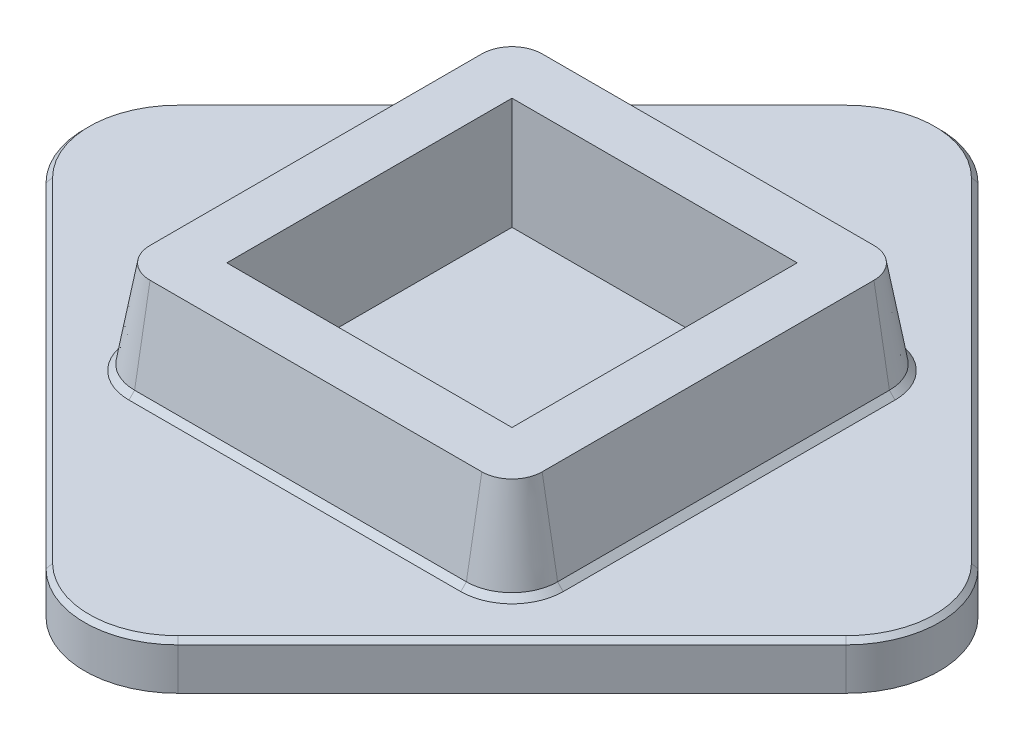
ISO-10303-21;
HEADER;
FILE_DESCRIPTION(('STEP AP214'),'2;1');
FILE_NAME('part.step','',(''),(''),'','','');
FILE_SCHEMA(('AUTOMOTIVE_DESIGN { 1 0 10303 214 1 1 1 1 }'));
ENDSEC;
DATA;
#1=APPLICATION_CONTEXT('core data for automotive mechanical design processes');
#2=APPLICATION_PROTOCOL_DEFINITION('international standard','automotive_design',2000,#1);
#3=PRODUCT_CONTEXT('',#1,'mechanical');
#4=PRODUCT('Part','Part','',(#3));
#5=PRODUCT_RELATED_PRODUCT_CATEGORY('part','',(#4));
#6=PRODUCT_DEFINITION_FORMATION('','',#4);
#7=PRODUCT_DEFINITION_CONTEXT('part definition',#1,'design');
#8=PRODUCT_DEFINITION('design','',#6,#7);
#9=PRODUCT_DEFINITION_SHAPE('','',#8);
#10=(LENGTH_UNIT() NAMED_UNIT(*) SI_UNIT(.MILLI.,.METRE.));
#11=(NAMED_UNIT(*) PLANE_ANGLE_UNIT() SI_UNIT($,.RADIAN.));
#12=(NAMED_UNIT(*) SI_UNIT($,.STERADIAN.) SOLID_ANGLE_UNIT());
#13=UNCERTAINTY_MEASURE_WITH_UNIT(LENGTH_MEASURE(1.E-05),#10,'distance_accuracy_value','');
#14=(GEOMETRIC_REPRESENTATION_CONTEXT(3) GLOBAL_UNCERTAINTY_ASSIGNED_CONTEXT((#13)) GLOBAL_UNIT_ASSIGNED_CONTEXT((#10,
#11,#12)) REPRESENTATION_CONTEXT('',''));
#15=CARTESIAN_POINT('',(0.,0.,0.));
#16=DIRECTION('',(0.,0.,1.));
#17=DIRECTION('',(1.,0.,0.));
#18=AXIS2_PLACEMENT_3D('',#15,#16,#17);
#19=CARTESIAN_POINT('',(17.8,15.,-17.8));
#20=DIRECTION('',(0.,1.,0.));
#21=DIRECTION('',(0.,0.,1.));
#22=AXIS2_PLACEMENT_3D('',#19,#20,#21);
#23=PLANE('',#22);
#24=CARTESIAN_POINT('',(17.8,15.,-17.8));
#25=DIRECTION('',(0.,1.,0.));
#26=DIRECTION('',(0.,0.,1.));
#27=AXIS2_PLACEMENT_3D('',#24,#25,#26);
#28=CIRCLE('',#27,3.23673019291535);
#29=CARTESIAN_POINT('',(21.0367301929153,15.,-17.8));
#30=VERTEX_POINT('',#29);
#31=CARTESIAN_POINT('',(17.8,15.,-21.0367301929153));
#32=VERTEX_POINT('',#31);
#33=EDGE_CURVE('E253',#30,#32,#28,.T.);
#34=ORIENTED_EDGE('',*,*,#33,.T.);
#35=DIRECTION('',(1.,0.,0.));
#36=VECTOR('',#35,1.);
#37=CARTESIAN_POINT('',(0.,15.,-21.0367301929153));
#38=LINE('',#37,#36);
#39=CARTESIAN_POINT('',(-17.8,15.,-21.0367301929153));
#40=VERTEX_POINT('',#39);
#41=EDGE_CURVE('E290',#40,#32,#38,.T.);
#42=ORIENTED_EDGE('',*,*,#41,.F.);
#43=CARTESIAN_POINT('',(-17.8,15.,-17.8));
#44=DIRECTION('',(0.,1.,0.));
#45=DIRECTION('',(0.,0.,1.));
#46=AXIS2_PLACEMENT_3D('',#43,#44,#45);
#47=CIRCLE('',#46,3.23673019291535);
#48=CARTESIAN_POINT('',(-21.0367301929153,15.,-17.8));
#49=VERTEX_POINT('',#48);
#50=EDGE_CURVE('E293',#40,#49,#47,.T.);
#51=ORIENTED_EDGE('',*,*,#50,.T.);
#52=DIRECTION('',(0.,0.,-1.));
#53=VECTOR('',#52,1.);
#54=CARTESIAN_POINT('',(-21.0367301929153,15.,0.));
#55=LINE('',#54,#53);
#56=CARTESIAN_POINT('',(-21.0367301929153,15.,17.8));
#57=VERTEX_POINT('',#56);
#58=EDGE_CURVE('E295',#49,#57,#55,.F.);
#59=ORIENTED_EDGE('',*,*,#58,.T.);
#60=CARTESIAN_POINT('',(-17.8,15.,17.8));
#61=DIRECTION('',(0.,1.,0.));
#62=DIRECTION('',(0.,0.,1.));
#63=AXIS2_PLACEMENT_3D('',#60,#61,#62);
#64=CIRCLE('',#63,3.23673019291535);
#65=CARTESIAN_POINT('',(-17.8,15.,21.0367301929153));
#66=VERTEX_POINT('',#65);
#67=EDGE_CURVE('E297',#57,#66,#64,.T.);
#68=ORIENTED_EDGE('',*,*,#67,.T.);
#69=DIRECTION('',(-1.,0.,0.));
#70=VECTOR('',#69,1.);
#71=CARTESIAN_POINT('',(0.,15.,21.0367301929153));
#72=LINE('',#71,#70);
#73=CARTESIAN_POINT('',(17.8,15.,21.0367301929153));
#74=VERTEX_POINT('',#73);
#75=EDGE_CURVE('E299',#66,#74,#72,.F.);
#76=ORIENTED_EDGE('',*,*,#75,.T.);
#77=CARTESIAN_POINT('',(17.8,15.,17.8));
#78=DIRECTION('',(0.,1.,0.));
#79=DIRECTION('',(0.,0.,1.));
#80=AXIS2_PLACEMENT_3D('',#77,#78,#79);
#81=CIRCLE('',#80,3.23673019291535);
#82=CARTESIAN_POINT('',(21.0367301929153,15.,17.8));
#83=VERTEX_POINT('',#82);
#84=EDGE_CURVE('E301',#74,#83,#81,.T.);
#85=ORIENTED_EDGE('',*,*,#84,.T.);
#86=DIRECTION('',(0.,0.,1.));
#87=VECTOR('',#86,1.);
#88=CARTESIAN_POINT('',(21.0367301929153,15.,0.));
#89=LINE('',#88,#87);
#90=EDGE_CURVE('E274',#30,#83,#89,.T.);
#91=ORIENTED_EDGE('',*,*,#90,.F.);
#92=EDGE_LOOP('',(#34,#42,#51,#59,#68,#76,#85,#91));
#93=FACE_BOUND('',#92,.T.);
#94=DIRECTION('',(0.,0.,-1.));
#95=VECTOR('',#94,1.);
#96=CARTESIAN_POINT('',(15.3,15.,15.3));
#97=LINE('',#96,#95);
#98=CARTESIAN_POINT('',(15.3,15.,15.3));
#99=VERTEX_POINT('',#98);
#100=CARTESIAN_POINT('',(15.3,15.,-15.3));
#101=VERTEX_POINT('',#100);
#102=EDGE_CURVE('E233',#99,#101,#97,.T.);
#103=ORIENTED_EDGE('',*,*,#102,.F.);
#104=DIRECTION('',(1.,0.,0.));
#105=VECTOR('',#104,1.);
#106=CARTESIAN_POINT('',(-15.3,15.,15.3));
#107=LINE('',#106,#105);
#108=CARTESIAN_POINT('',(-15.3,15.,15.3));
#109=VERTEX_POINT('',#108);
#110=EDGE_CURVE('E243',#109,#99,#107,.T.);
#111=ORIENTED_EDGE('',*,*,#110,.F.);
#112=DIRECTION('',(0.,0.,1.));
#113=VECTOR('',#112,1.);
#114=CARTESIAN_POINT('',(-15.3,15.,-15.3));
#115=LINE('',#114,#113);
#116=CARTESIAN_POINT('',(-15.3,15.,-15.3));
#117=VERTEX_POINT('',#116);
#118=EDGE_CURVE('E249',#117,#109,#115,.T.);
#119=ORIENTED_EDGE('',*,*,#118,.F.);
#120=DIRECTION('',(-1.,0.,0.));
#121=VECTOR('',#120,1.);
#122=CARTESIAN_POINT('',(15.3,15.,-15.3));
#123=LINE('',#122,#121);
#124=EDGE_CURVE('E251',#101,#117,#123,.T.);
#125=ORIENTED_EDGE('',*,*,#124,.F.);
#126=EDGE_LOOP('',(#103,#111,#119,#125));
#127=FACE_BOUND('',#126,.T.);
#128=ADVANCED_FACE('F41',(#93,#127),#23,.T.);
#129=CARTESIAN_POINT('',(25.,5.,-25.));
#130=DIRECTION('',(-0.707106781186547,0.,0.707106781186548));
#131=DIRECTION('',(0.707106781186548,0.,0.707106781186547));
#132=AXIS2_PLACEMENT_3D('',#129,#130,#131);
#133=PLANE('',#132);
#134=DIRECTION('',(0.,-1.,0.));
#135=VECTOR('',#134,1.);
#136=CARTESIAN_POINT('',(7.07106781186547,5.,-42.9289321881345));
#137=LINE('',#136,#135);
#138=CARTESIAN_POINT('',(7.07106781186547,4.5,-42.9289321881345));
#139=VERTEX_POINT('',#138);
#140=CARTESIAN_POINT('',(7.07106781186547,0.,-42.9289321881345));
#141=VERTEX_POINT('',#140);
#142=EDGE_CURVE('E342',#139,#141,#137,.T.);
#143=ORIENTED_EDGE('',*,*,#142,.F.);
#144=DIRECTION('',(0.707106781186548,0.,0.707106781186547));
#145=VECTOR('',#144,1.);
#146=CARTESIAN_POINT('',(42.9289321881345,4.5,-7.07106781186548));
#147=LINE('',#146,#145);
#148=CARTESIAN_POINT('',(42.9289321881345,4.5,-7.07106781186547));
#149=VERTEX_POINT('',#148);
#150=EDGE_CURVE('E393',#139,#149,#147,.T.);
#151=ORIENTED_EDGE('',*,*,#150,.T.);
#152=DIRECTION('',(0.,-1.,0.));
#153=VECTOR('',#152,1.);
#154=CARTESIAN_POINT('',(42.9289321881345,5.,-7.07106781186547));
#155=LINE('',#154,#153);
#156=CARTESIAN_POINT('',(42.9289321881345,0.,-7.07106781186547));
#157=VERTEX_POINT('',#156);
#158=EDGE_CURVE('E328',#149,#157,#155,.T.);
#159=ORIENTED_EDGE('',*,*,#158,.T.);
#160=DIRECTION('',(-0.707106781186548,0.,-0.707106781186547));
#161=VECTOR('',#160,1.);
#162=CARTESIAN_POINT('',(25.,0.,-25.));
#163=LINE('',#162,#161);
#164=EDGE_CURVE('E269',#157,#141,#163,.T.);
#165=ORIENTED_EDGE('',*,*,#164,.T.);
#166=EDGE_LOOP('',(#143,#151,#159,#165));
#167=FACE_BOUND('',#166,.T.);
#168=ADVANCED_FACE('F519',(#167),#133,.F.);
#169=CARTESIAN_POINT('',(0.,5.,-35.8578643762691));
#170=DIRECTION('',(0.,-1.,0.));
#171=DIRECTION('',(0.,0.,-1.));
#172=AXIS2_PLACEMENT_3D('',#169,#170,#171);
#173=CYLINDRICAL_SURFACE('',#172,10.);
#174=DIRECTION('',(0.,-1.,0.));
#175=VECTOR('',#174,1.);
#176=CARTESIAN_POINT('',(-7.07106781186547,5.,-42.9289321881345));
#177=LINE('',#176,#175);
#178=CARTESIAN_POINT('',(-7.07106781186547,4.5,-42.9289321881345));
#179=VERTEX_POINT('',#178);
#180=CARTESIAN_POINT('',(-7.07106781186547,0.,-42.9289321881345));
#181=VERTEX_POINT('',#180);
#182=EDGE_CURVE('E340',#179,#181,#177,.T.);
#183=ORIENTED_EDGE('',*,*,#182,.F.);
#184=CARTESIAN_POINT('',(0.,4.5,-35.8578643762691));
#185=DIRECTION('',(0.,1.,0.));
#186=DIRECTION('',(0.,0.,1.));
#187=AXIS2_PLACEMENT_3D('',#184,#185,#186);
#188=CIRCLE('',#187,10.);
#189=EDGE_CURVE('E391',#179,#139,#188,.F.);
#190=ORIENTED_EDGE('',*,*,#189,.T.);
#191=ORIENTED_EDGE('',*,*,#142,.T.);
#192=CARTESIAN_POINT('',(0.,0.,-35.8578643762691));
#193=DIRECTION('',(0.,1.,0.));
#194=DIRECTION('',(0.,0.,1.));
#195=AXIS2_PLACEMENT_3D('',#192,#193,#194);
#196=CIRCLE('',#195,10.);
#197=EDGE_CURVE('E307',#141,#181,#196,.T.);
#198=ORIENTED_EDGE('',*,*,#197,.T.);
#199=EDGE_LOOP('',(#183,#190,#191,#198));
#200=FACE_BOUND('',#199,.T.);
#201=ADVANCED_FACE('F524',(#200),#173,.T.);
#202=CARTESIAN_POINT('',(-25.,5.,-25.));
#203=DIRECTION('',(-0.707106781186547,0.,-0.707106781186548));
#204=DIRECTION('',(-0.707106781186548,0.,0.707106781186547));
#205=AXIS2_PLACEMENT_3D('',#202,#203,#204);
#206=PLANE('',#205);
#207=DIRECTION('',(0.,-1.,0.));
#208=VECTOR('',#207,1.);
#209=CARTESIAN_POINT('',(-42.9289321881345,5.,-7.07106781186547));
#210=LINE('',#209,#208);
#211=CARTESIAN_POINT('',(-42.9289321881345,4.5,-7.07106781186547));
#212=VERTEX_POINT('',#211);
#213=CARTESIAN_POINT('',(-42.9289321881345,0.,-7.07106781186547));
#214=VERTEX_POINT('',#213);
#215=EDGE_CURVE('E338',#212,#214,#210,.T.);
#216=ORIENTED_EDGE('',*,*,#215,.F.);
#217=DIRECTION('',(0.707106781186548,0.,-0.707106781186547));
#218=VECTOR('',#217,1.);
#219=CARTESIAN_POINT('',(-25.,4.5,-25.));
#220=LINE('',#219,#218);
#221=EDGE_CURVE('E389',#212,#179,#220,.T.);
#222=ORIENTED_EDGE('',*,*,#221,.T.);
#223=ORIENTED_EDGE('',*,*,#182,.T.);
#224=DIRECTION('',(0.707106781186548,0.,-0.707106781186547));
#225=VECTOR('',#224,1.);
#226=CARTESIAN_POINT('',(-25.,0.,-25.));
#227=LINE('',#226,#225);
#228=EDGE_CURVE('E310',#214,#181,#227,.T.);
#229=ORIENTED_EDGE('',*,*,#228,.F.);
#230=EDGE_LOOP('',(#216,#222,#223,#229));
#231=FACE_BOUND('',#230,.T.);
#232=ADVANCED_FACE('F575',(#231),#206,.T.);
#233=CARTESIAN_POINT('',(-35.8578643762691,5.,0.));
#234=DIRECTION('',(0.,-1.,0.));
#235=DIRECTION('',(0.,0.,-1.));
#236=AXIS2_PLACEMENT_3D('',#233,#234,#235);
#237=CYLINDRICAL_SURFACE('',#236,10.);
#238=DIRECTION('',(0.,-1.,0.));
#239=VECTOR('',#238,1.);
#240=CARTESIAN_POINT('',(-42.9289321881345,5.,7.07106781186549));
#241=LINE('',#240,#239);
#242=CARTESIAN_POINT('',(-42.9289321881345,4.5,7.07106781186549));
#243=VERTEX_POINT('',#242);
#244=CARTESIAN_POINT('',(-42.9289321881345,0.,7.07106781186549));
#245=VERTEX_POINT('',#244);
#246=EDGE_CURVE('E336',#243,#245,#241,.T.);
#247=ORIENTED_EDGE('',*,*,#246,.F.);
#248=CARTESIAN_POINT('',(-35.8578643762691,4.5,0.));
#249=DIRECTION('',(0.,1.,0.));
#250=DIRECTION('',(0.,0.,1.));
#251=AXIS2_PLACEMENT_3D('',#248,#249,#250);
#252=CIRCLE('',#251,10.);
#253=EDGE_CURVE('E387',#243,#212,#252,.F.);
#254=ORIENTED_EDGE('',*,*,#253,.T.);
#255=ORIENTED_EDGE('',*,*,#215,.T.);
#256=CARTESIAN_POINT('',(-35.8578643762691,0.,0.));
#257=DIRECTION('',(0.,1.,0.));
#258=DIRECTION('',(0.,0.,1.));
#259=AXIS2_PLACEMENT_3D('',#256,#257,#258);
#260=CIRCLE('',#259,10.);
#261=EDGE_CURVE('E313',#245,#214,#260,.F.);
#262=ORIENTED_EDGE('',*,*,#261,.F.);
#263=EDGE_LOOP('',(#247,#254,#255,#262));
#264=FACE_BOUND('',#263,.T.);
#265=ADVANCED_FACE('F571',(#264),#237,.T.);
#266=CARTESIAN_POINT('',(-25.,5.,25.));
#267=DIRECTION('',(-0.707106781186547,0.,0.707106781186548));
#268=DIRECTION('',(0.707106781186548,0.,0.707106781186547));
#269=AXIS2_PLACEMENT_3D('',#266,#267,#268);
#270=PLANE('',#269);
#271=DIRECTION('',(0.,-1.,0.));
#272=VECTOR('',#271,1.);
#273=CARTESIAN_POINT('',(-7.07106781186547,5.,42.9289321881345));
#274=LINE('',#273,#272);
#275=CARTESIAN_POINT('',(-7.07106781186547,4.5,42.9289321881345));
#276=VERTEX_POINT('',#275);
#277=CARTESIAN_POINT('',(-7.07106781186547,0.,42.9289321881345));
#278=VERTEX_POINT('',#277);
#279=EDGE_CURVE('E334',#276,#278,#274,.T.);
#280=ORIENTED_EDGE('',*,*,#279,.F.);
#281=DIRECTION('',(-0.707106781186548,0.,-0.707106781186547));
#282=VECTOR('',#281,1.);
#283=CARTESIAN_POINT('',(-25.,4.5,25.));
#284=LINE('',#283,#282);
#285=EDGE_CURVE('E385',#276,#243,#284,.T.);
#286=ORIENTED_EDGE('',*,*,#285,.T.);
#287=ORIENTED_EDGE('',*,*,#246,.T.);
#288=DIRECTION('',(-0.707106781186548,0.,-0.707106781186547));
#289=VECTOR('',#288,1.);
#290=CARTESIAN_POINT('',(-25.,0.,25.));
#291=LINE('',#290,#289);
#292=EDGE_CURVE('E316',#278,#245,#291,.T.);
#293=ORIENTED_EDGE('',*,*,#292,.F.);
#294=EDGE_LOOP('',(#280,#286,#287,#293));
#295=FACE_BOUND('',#294,.T.);
#296=ADVANCED_FACE('F567',(#295),#270,.T.);
#297=CARTESIAN_POINT('',(0.,5.,35.8578643762691));
#298=DIRECTION('',(0.,-1.,0.));
#299=DIRECTION('',(0.,0.,-1.));
#300=AXIS2_PLACEMENT_3D('',#297,#298,#299);
#301=CYLINDRICAL_SURFACE('',#300,9.99999999999999);
#302=DIRECTION('',(0.,-1.,0.));
#303=VECTOR('',#302,1.);
#304=CARTESIAN_POINT('',(7.07106781186547,5.,42.9289321881345));
#305=LINE('',#304,#303);
#306=CARTESIAN_POINT('',(7.07106781186547,4.5,42.9289321881345));
#307=VERTEX_POINT('',#306);
#308=CARTESIAN_POINT('',(7.07106781186547,0.,42.9289321881345));
#309=VERTEX_POINT('',#308);
#310=EDGE_CURVE('E332',#307,#309,#305,.T.);
#311=ORIENTED_EDGE('',*,*,#310,.F.);
#312=CARTESIAN_POINT('',(0.,4.5,35.8578643762691));
#313=DIRECTION('',(0.,1.,0.));
#314=DIRECTION('',(0.,0.,1.));
#315=AXIS2_PLACEMENT_3D('',#312,#313,#314);
#316=CIRCLE('',#315,9.99999999999999);
#317=EDGE_CURVE('E383',#307,#276,#316,.F.);
#318=ORIENTED_EDGE('',*,*,#317,.T.);
#319=ORIENTED_EDGE('',*,*,#279,.T.);
#320=CARTESIAN_POINT('',(0.,0.,35.8578643762691));
#321=DIRECTION('',(0.,1.,0.));
#322=DIRECTION('',(0.,0.,1.));
#323=AXIS2_PLACEMENT_3D('',#320,#321,#322);
#324=CIRCLE('',#323,9.99999999999999);
#325=EDGE_CURVE('E319',#278,#309,#324,.T.);
#326=ORIENTED_EDGE('',*,*,#325,.T.);
#327=EDGE_LOOP('',(#311,#318,#319,#326));
#328=FACE_BOUND('',#327,.T.);
#329=ADVANCED_FACE('F563',(#328),#301,.T.);
#330=CARTESIAN_POINT('',(25.,5.,25.));
#331=DIRECTION('',(-0.707106781186547,0.,-0.707106781186548));
#332=DIRECTION('',(-0.707106781186548,0.,0.707106781186547));
#333=AXIS2_PLACEMENT_3D('',#330,#331,#332);
#334=PLANE('',#333);
#335=DIRECTION('',(0.,-1.,0.));
#336=VECTOR('',#335,1.);
#337=CARTESIAN_POINT('',(42.9289321881345,5.,7.07106781186548));
#338=LINE('',#337,#336);
#339=CARTESIAN_POINT('',(42.9289321881345,4.5,7.07106781186548));
#340=VERTEX_POINT('',#339);
#341=CARTESIAN_POINT('',(42.9289321881345,0.,7.07106781186548));
#342=VERTEX_POINT('',#341);
#343=EDGE_CURVE('E330',#340,#342,#338,.T.);
#344=ORIENTED_EDGE('',*,*,#343,.F.);
#345=DIRECTION('',(-0.707106781186548,0.,0.707106781186547));
#346=VECTOR('',#345,1.);
#347=CARTESIAN_POINT('',(7.07106781186547,4.5,42.9289321881345));
#348=LINE('',#347,#346);
#349=EDGE_CURVE('E381',#340,#307,#348,.T.);
#350=ORIENTED_EDGE('',*,*,#349,.T.);
#351=ORIENTED_EDGE('',*,*,#310,.T.);
#352=DIRECTION('',(0.707106781186548,0.,-0.707106781186547));
#353=VECTOR('',#352,1.);
#354=CARTESIAN_POINT('',(25.,0.,25.));
#355=LINE('',#354,#353);
#356=EDGE_CURVE('E322',#309,#342,#355,.T.);
#357=ORIENTED_EDGE('',*,*,#356,.T.);
#358=EDGE_LOOP('',(#344,#350,#351,#357));
#359=FACE_BOUND('',#358,.T.);
#360=ADVANCED_FACE('F559',(#359),#334,.F.);
#361=CARTESIAN_POINT('',(35.8578643762691,5.,0.));
#362=DIRECTION('',(0.,-1.,0.));
#363=DIRECTION('',(0.,0.,-1.));
#364=AXIS2_PLACEMENT_3D('',#361,#362,#363);
#365=CYLINDRICAL_SURFACE('',#364,10.);
#366=ORIENTED_EDGE('',*,*,#158,.F.);
#367=CARTESIAN_POINT('',(35.8578643762691,4.5,0.));
#368=DIRECTION('',(0.,1.,0.));
#369=DIRECTION('',(0.,0.,1.));
#370=AXIS2_PLACEMENT_3D('',#367,#368,#369);
#371=CIRCLE('',#370,10.);
#372=EDGE_CURVE('E378',#149,#340,#371,.F.);
#373=ORIENTED_EDGE('',*,*,#372,.T.);
#374=ORIENTED_EDGE('',*,*,#343,.T.);
#375=CARTESIAN_POINT('',(35.8578643762691,0.,0.));
#376=DIRECTION('',(0.,1.,0.));
#377=DIRECTION('',(0.,0.,1.));
#378=AXIS2_PLACEMENT_3D('',#375,#376,#377);
#379=CIRCLE('',#378,10.);
#380=EDGE_CURVE('E325',#342,#157,#379,.T.);
#381=ORIENTED_EDGE('',*,*,#380,.T.);
#382=EDGE_LOOP('',(#366,#373,#374,#381));
#383=FACE_BOUND('',#382,.T.);
#384=ADVANCED_FACE('F552',(#383),#365,.T.);
#385=CARTESIAN_POINT('',(0.,5.,0.));
#386=DIRECTION('',(0.,1.,0.));
#387=DIRECTION('',(0.,0.,1.));
#388=AXIS2_PLACEMENT_3D('',#385,#386,#387);
#389=PLANE('',#388);
#390=DIRECTION('',(0.707106781186548,0.,-0.707106781186547));
#391=VECTOR('',#390,1.);
#392=CARTESIAN_POINT('',(42.5753787975413,5.,6.71751442127221));
#393=LINE('',#392,#391);
#394=CARTESIAN_POINT('',(6.7175144212722,5.,42.5753787975413));
#395=VERTEX_POINT('',#394);
#396=CARTESIAN_POINT('',(42.5753787975413,5.,6.71751442127221));
#397=VERTEX_POINT('',#396);
#398=EDGE_CURVE('E373',#395,#397,#393,.T.);
#399=ORIENTED_EDGE('',*,*,#398,.T.);
#400=CARTESIAN_POINT('',(35.8578643762691,5.,0.));
#401=DIRECTION('',(0.,1.,0.));
#402=DIRECTION('',(0.,0.,1.));
#403=AXIS2_PLACEMENT_3D('',#400,#401,#402);
#404=CIRCLE('',#403,9.49999999999999);
#405=CARTESIAN_POINT('',(42.5753787975413,5.,-6.71751442127221));
#406=VERTEX_POINT('',#405);
#407=EDGE_CURVE('E375',#397,#406,#404,.T.);
#408=ORIENTED_EDGE('',*,*,#407,.T.);
#409=DIRECTION('',(-0.707106781186548,0.,-0.707106781186547));
#410=VECTOR('',#409,1.);
#411=CARTESIAN_POINT('',(6.7175144212722,5.,-42.5753787975413));
#412=LINE('',#411,#410);
#413=CARTESIAN_POINT('',(6.71751442127221,5.,-42.5753787975413));
#414=VERTEX_POINT('',#413);
#415=EDGE_CURVE('E361',#406,#414,#412,.T.);
#416=ORIENTED_EDGE('',*,*,#415,.T.);
#417=CARTESIAN_POINT('',(0.,5.,-35.8578643762691));
#418=DIRECTION('',(0.,1.,0.));
#419=DIRECTION('',(0.,0.,1.));
#420=AXIS2_PLACEMENT_3D('',#417,#418,#419);
#421=CIRCLE('',#420,9.5);
#422=CARTESIAN_POINT('',(-6.7175144212722,5.,-42.5753787975413));
#423=VERTEX_POINT('',#422);
#424=EDGE_CURVE('E363',#414,#423,#421,.T.);
#425=ORIENTED_EDGE('',*,*,#424,.T.);
#426=DIRECTION('',(-0.707106781186548,0.,0.707106781186547));
#427=VECTOR('',#426,1.);
#428=CARTESIAN_POINT('',(-24.6464466094067,5.,-24.6464466094067));
#429=LINE('',#428,#427);
#430=CARTESIAN_POINT('',(-42.5753787975413,5.,-6.71751442127221));
#431=VERTEX_POINT('',#430);
#432=EDGE_CURVE('E365',#423,#431,#429,.T.);
#433=ORIENTED_EDGE('',*,*,#432,.T.);
#434=CARTESIAN_POINT('',(-35.8578643762691,5.,0.));
#435=DIRECTION('',(0.,1.,0.));
#436=DIRECTION('',(0.,0.,1.));
#437=AXIS2_PLACEMENT_3D('',#434,#435,#436);
#438=CIRCLE('',#437,9.50000000000001);
#439=CARTESIAN_POINT('',(-42.5753787975413,5.,6.71751442127221));
#440=VERTEX_POINT('',#439);
#441=EDGE_CURVE('E367',#431,#440,#438,.T.);
#442=ORIENTED_EDGE('',*,*,#441,.T.);
#443=DIRECTION('',(0.707106781186548,0.,0.707106781186547));
#444=VECTOR('',#443,1.);
#445=CARTESIAN_POINT('',(-24.6464466094067,5.,24.6464466094067));
#446=LINE('',#445,#444);
#447=CARTESIAN_POINT('',(-6.7175144212722,5.,42.5753787975413));
#448=VERTEX_POINT('',#447);
#449=EDGE_CURVE('E369',#440,#448,#446,.T.);
#450=ORIENTED_EDGE('',*,*,#449,.T.);
#451=CARTESIAN_POINT('',(0.,5.,35.8578643762691));
#452=DIRECTION('',(0.,1.,0.));
#453=DIRECTION('',(0.,0.,1.));
#454=AXIS2_PLACEMENT_3D('',#451,#452,#453);
#455=CIRCLE('',#454,9.5);
#456=EDGE_CURVE('E371',#448,#395,#455,.T.);
#457=ORIENTED_EDGE('',*,*,#456,.T.);
#458=EDGE_LOOP('',(#399,#408,#416,#425,#433,#442,#450,#457));
#459=FACE_BOUND('',#458,.T.);
#460=CARTESIAN_POINT('',(-17.8,5.,-17.8));
#461=DIRECTION('',(0.,1.,0.));
#462=DIRECTION('',(0.,0.,1.));
#463=AXIS2_PLACEMENT_3D('',#460,#461,#462);
#464=CIRCLE('',#463,5.50000000000002);
#465=CARTESIAN_POINT('',(-23.3,5.,-17.8));
#466=VERTEX_POINT('',#465);
#467=CARTESIAN_POINT('',(-17.8,5.,-23.3));
#468=VERTEX_POINT('',#467);
#469=EDGE_CURVE('E356',#466,#468,#464,.F.);
#470=ORIENTED_EDGE('',*,*,#469,.T.);
#471=DIRECTION('',(1.,0.,0.));
#472=VECTOR('',#471,1.);
#473=CARTESIAN_POINT('',(17.8,5.,-23.3));
#474=LINE('',#473,#472);
#475=CARTESIAN_POINT('',(17.8,5.,-23.3));
#476=VERTEX_POINT('',#475);
#477=EDGE_CURVE('E358',#468,#476,#474,.T.);
#478=ORIENTED_EDGE('',*,*,#477,.T.);
#479=CARTESIAN_POINT('',(17.8,5.,-17.8));
#480=DIRECTION('',(0.,1.,0.));
#481=DIRECTION('',(0.,0.,1.));
#482=AXIS2_PLACEMENT_3D('',#479,#480,#481);
#483=CIRCLE('',#482,5.50000000000002);
#484=CARTESIAN_POINT('',(23.3,5.,-17.8));
#485=VERTEX_POINT('',#484);
#486=EDGE_CURVE('E344',#476,#485,#483,.F.);
#487=ORIENTED_EDGE('',*,*,#486,.T.);
#488=DIRECTION('',(0.,0.,1.));
#489=VECTOR('',#488,1.);
#490=CARTESIAN_POINT('',(23.3,5.,17.8));
#491=LINE('',#490,#489);
#492=CARTESIAN_POINT('',(23.3,5.,17.8));
#493=VERTEX_POINT('',#492);
#494=EDGE_CURVE('E346',#485,#493,#491,.T.);
#495=ORIENTED_EDGE('',*,*,#494,.T.);
#496=CARTESIAN_POINT('',(17.8,5.,17.8));
#497=DIRECTION('',(0.,1.,0.));
#498=DIRECTION('',(0.,0.,1.));
#499=AXIS2_PLACEMENT_3D('',#496,#497,#498);
#500=CIRCLE('',#499,5.50000000000002);
#501=CARTESIAN_POINT('',(17.8,5.,23.3));
#502=VERTEX_POINT('',#501);
#503=EDGE_CURVE('E348',#493,#502,#500,.F.);
#504=ORIENTED_EDGE('',*,*,#503,.T.);
#505=DIRECTION('',(-1.,0.,0.));
#506=VECTOR('',#505,1.);
#507=CARTESIAN_POINT('',(0.,5.,23.3));
#508=LINE('',#507,#506);
#509=CARTESIAN_POINT('',(-17.8,5.,23.3));
#510=VERTEX_POINT('',#509);
#511=EDGE_CURVE('E350',#502,#510,#508,.T.);
#512=ORIENTED_EDGE('',*,*,#511,.T.);
#513=CARTESIAN_POINT('',(-17.8,5.,17.8));
#514=DIRECTION('',(0.,1.,0.));
#515=DIRECTION('',(0.,0.,1.));
#516=AXIS2_PLACEMENT_3D('',#513,#514,#515);
#517=CIRCLE('',#516,5.50000000000002);
#518=CARTESIAN_POINT('',(-23.3,5.,17.8));
#519=VERTEX_POINT('',#518);
#520=EDGE_CURVE('E352',#510,#519,#517,.F.);
#521=ORIENTED_EDGE('',*,*,#520,.T.);
#522=DIRECTION('',(0.,0.,-1.));
#523=VECTOR('',#522,1.);
#524=CARTESIAN_POINT('',(-23.3,5.,0.));
#525=LINE('',#524,#523);
#526=EDGE_CURVE('E354',#519,#466,#525,.T.);
#527=ORIENTED_EDGE('',*,*,#526,.T.);
#528=EDGE_LOOP('',(#470,#478,#487,#495,#504,#512,#521,#527));
#529=FACE_BOUND('',#528,.T.);
#530=ADVANCED_FACE('F488',(#459,#529),#389,.T.);
#531=CARTESIAN_POINT('',(0.,0.,0.));
#532=DIRECTION('',(0.,1.,0.));
#533=DIRECTION('',(0.,0.,1.));
#534=AXIS2_PLACEMENT_3D('',#531,#532,#533);
#535=PLANE('',#534);
#536=ORIENTED_EDGE('',*,*,#164,.F.);
#537=ORIENTED_EDGE('',*,*,#380,.F.);
#538=ORIENTED_EDGE('',*,*,#356,.F.);
#539=ORIENTED_EDGE('',*,*,#325,.F.);
#540=ORIENTED_EDGE('',*,*,#292,.T.);
#541=ORIENTED_EDGE('',*,*,#261,.T.);
#542=ORIENTED_EDGE('',*,*,#228,.T.);
#543=ORIENTED_EDGE('',*,*,#197,.F.);
#544=EDGE_LOOP('',(#536,#537,#538,#539,#540,#541,#542,#543));
#545=FACE_BOUND('',#544,.T.);
#546=ADVANCED_FACE('F532',(#545),#535,.F.);
#547=CARTESIAN_POINT('',(17.8,5.,-17.8));
#548=DIRECTION('',(0.,-1.,0.));
#549=DIRECTION('',(0.,0.,1.));
#550=AXIS2_PLACEMENT_3D('',#547,#548,#549);
#551=CONICAL_SURFACE('',#550,5.,0.174532925199433);
#552=DIRECTION('',(0.173648177666931,-0.984807753012208,0.));
#553=VECTOR('',#552,1.);
#554=CARTESIAN_POINT('',(22.8,5.,-17.8));
#555=LINE('',#554,#553);
#556=CARTESIAN_POINT('',(22.6929629983145,5.60703700168555,-17.8));
#557=VERTEX_POINT('',#556);
#558=EDGE_CURVE('E271',#30,#557,#555,.T.);
#559=ORIENTED_EDGE('',*,*,#558,.T.);
#560=CARTESIAN_POINT('',(17.8,5.60703700168555,-17.8));
#561=DIRECTION('',(0.,1.,0.));
#562=DIRECTION('',(0.,0.,1.));
#563=AXIS2_PLACEMENT_3D('',#560,#561,#562);
#564=CIRCLE('',#563,4.89296299831447);
#565=CARTESIAN_POINT('',(17.8,5.60703700168555,-22.6929629983145));
#566=VERTEX_POINT('',#565);
#567=EDGE_CURVE('E11',#557,#566,#564,.T.);
#568=ORIENTED_EDGE('',*,*,#567,.T.);
#569=DIRECTION('',(0.,-0.984807753012208,-0.173648177666931));
#570=VECTOR('',#569,1.);
#571=CARTESIAN_POINT('',(17.8,5.,-22.8));
#572=LINE('',#571,#570);
#573=EDGE_CURVE('E266',#32,#566,#572,.T.);
#574=ORIENTED_EDGE('',*,*,#573,.F.);
#575=ORIENTED_EDGE('',*,*,#33,.F.);
#576=EDGE_LOOP('',(#559,#568,#574,#575));
#577=FACE_BOUND('',#576,.T.);
#578=ADVANCED_FACE('F502',(#577),#551,.T.);
#579=CARTESIAN_POINT('',(0.,5.,-22.8));
#580=DIRECTION('',(0.,0.173648177666931,-0.984807753012208));
#581=DIRECTION('',(0.,0.984807753012208,0.173648177666931));
#582=AXIS2_PLACEMENT_3D('',#579,#580,#581);
#583=PLANE('',#582);
#584=ORIENTED_EDGE('',*,*,#573,.T.);
#585=DIRECTION('',(-1.,0.,0.));
#586=VECTOR('',#585,1.);
#587=CARTESIAN_POINT('',(-17.8,5.60703700168555,-22.6929629983145));
#588=LINE('',#587,#586);
#589=CARTESIAN_POINT('',(-17.8,5.60703700168555,-22.6929629983145));
#590=VERTEX_POINT('',#589);
#591=EDGE_CURVE('E395',#566,#590,#588,.T.);
#592=ORIENTED_EDGE('',*,*,#591,.T.);
#593=DIRECTION('',(0.,-0.984807753012208,-0.173648177666931));
#594=VECTOR('',#593,1.);
#595=CARTESIAN_POINT('',(-17.8,5.,-22.8));
#596=LINE('',#595,#594);
#597=EDGE_CURVE('E270',#40,#590,#596,.T.);
#598=ORIENTED_EDGE('',*,*,#597,.F.);
#599=ORIENTED_EDGE('',*,*,#41,.T.);
#600=EDGE_LOOP('',(#584,#592,#598,#599));
#601=FACE_BOUND('',#600,.T.);
#602=ADVANCED_FACE('F506',(#601),#583,.T.);
#603=CARTESIAN_POINT('',(-17.8,5.,-17.8));
#604=DIRECTION('',(0.,-1.,0.));
#605=DIRECTION('',(0.,0.,1.));
#606=AXIS2_PLACEMENT_3D('',#603,#604,#605);
#607=CONICAL_SURFACE('',#606,5.,0.174532925199433);
#608=ORIENTED_EDGE('',*,*,#597,.T.);
#609=CARTESIAN_POINT('',(-17.8,5.60703700168555,-17.8));
#610=DIRECTION('',(0.,1.,0.));
#611=DIRECTION('',(0.,0.,1.));
#612=AXIS2_PLACEMENT_3D('',#609,#610,#611);
#613=CIRCLE('',#612,4.89296299831447);
#614=CARTESIAN_POINT('',(-22.6929629983145,5.60703700168555,-17.8));
#615=VERTEX_POINT('',#614);
#616=EDGE_CURVE('E398',#590,#615,#613,.T.);
#617=ORIENTED_EDGE('',*,*,#616,.T.);
#618=DIRECTION('',(-0.173648177666931,-0.984807753012208,0.));
#619=VECTOR('',#618,1.);
#620=CARTESIAN_POINT('',(-22.8,5.,-17.8));
#621=LINE('',#620,#619);
#622=EDGE_CURVE('E284',#49,#615,#621,.T.);
#623=ORIENTED_EDGE('',*,*,#622,.F.);
#624=ORIENTED_EDGE('',*,*,#50,.F.);
#625=EDGE_LOOP('',(#608,#617,#623,#624));
#626=FACE_BOUND('',#625,.T.);
#627=ADVANCED_FACE('F544',(#626),#607,.T.);
#628=CARTESIAN_POINT('',(-22.8,5.,0.));
#629=DIRECTION('',(-0.984807753012208,0.173648177666931,0.));
#630=DIRECTION('',(-0.173648177666931,-0.984807753012208,0.));
#631=AXIS2_PLACEMENT_3D('',#628,#629,#630);
#632=PLANE('',#631);
#633=ORIENTED_EDGE('',*,*,#622,.T.);
#634=DIRECTION('',(0.,0.,-1.));
#635=VECTOR('',#634,1.);
#636=CARTESIAN_POINT('',(-22.6929629983145,5.60703700168555,0.));
#637=LINE('',#636,#635);
#638=CARTESIAN_POINT('',(-22.6929629983145,5.60703700168555,17.8));
#639=VERTEX_POINT('',#638);
#640=EDGE_CURVE('E400',#615,#639,#637,.F.);
#641=ORIENTED_EDGE('',*,*,#640,.T.);
#642=DIRECTION('',(-0.173648177666931,-0.984807753012208,0.));
#643=VECTOR('',#642,1.);
#644=CARTESIAN_POINT('',(-22.8,5.,17.8));
#645=LINE('',#644,#643);
#646=EDGE_CURVE('E281',#57,#639,#645,.T.);
#647=ORIENTED_EDGE('',*,*,#646,.F.);
#648=ORIENTED_EDGE('',*,*,#58,.F.);
#649=EDGE_LOOP('',(#633,#641,#647,#648));
#650=FACE_BOUND('',#649,.T.);
#651=ADVANCED_FACE('F474',(#650),#632,.T.);
#652=CARTESIAN_POINT('',(-17.8,5.,17.8));
#653=DIRECTION('',(0.,-1.,0.));
#654=DIRECTION('',(0.,0.,1.));
#655=AXIS2_PLACEMENT_3D('',#652,#653,#654);
#656=CONICAL_SURFACE('',#655,5.,0.174532925199433);
#657=ORIENTED_EDGE('',*,*,#646,.T.);
#658=CARTESIAN_POINT('',(-17.8,5.60703700168555,17.8));
#659=DIRECTION('',(0.,1.,0.));
#660=DIRECTION('',(0.,0.,1.));
#661=AXIS2_PLACEMENT_3D('',#658,#659,#660);
#662=CIRCLE('',#661,4.89296299831447);
#663=CARTESIAN_POINT('',(-17.8,5.60703700168555,22.6929629983145));
#664=VERTEX_POINT('',#663);
#665=EDGE_CURVE('E402',#639,#664,#662,.T.);
#666=ORIENTED_EDGE('',*,*,#665,.T.);
#667=DIRECTION('',(0.,-0.984807753012208,0.173648177666931));
#668=VECTOR('',#667,1.);
#669=CARTESIAN_POINT('',(-17.8,5.,22.8));
#670=LINE('',#669,#668);
#671=EDGE_CURVE('E278',#66,#664,#670,.T.);
#672=ORIENTED_EDGE('',*,*,#671,.F.);
#673=ORIENTED_EDGE('',*,*,#67,.F.);
#674=EDGE_LOOP('',(#657,#666,#672,#673));
#675=FACE_BOUND('',#674,.T.);
#676=ADVANCED_FACE('F472',(#675),#656,.T.);
#677=CARTESIAN_POINT('',(0.,5.,22.8));
#678=DIRECTION('',(0.,0.173648177666931,0.984807753012208));
#679=DIRECTION('',(0.,-0.984807753012208,0.173648177666931));
#680=AXIS2_PLACEMENT_3D('',#677,#678,#679);
#681=PLANE('',#680);
#682=ORIENTED_EDGE('',*,*,#671,.T.);
#683=DIRECTION('',(-1.,0.,0.));
#684=VECTOR('',#683,1.);
#685=CARTESIAN_POINT('',(0.,5.60703700168555,22.6929629983145));
#686=LINE('',#685,#684);
#687=CARTESIAN_POINT('',(17.8,5.60703700168555,22.6929629983145));
#688=VERTEX_POINT('',#687);
#689=EDGE_CURVE('E404',#664,#688,#686,.F.);
#690=ORIENTED_EDGE('',*,*,#689,.T.);
#691=DIRECTION('',(0.,-0.984807753012208,0.173648177666931));
#692=VECTOR('',#691,1.);
#693=CARTESIAN_POINT('',(17.8,5.,22.8));
#694=LINE('',#693,#692);
#695=EDGE_CURVE('E276',#74,#688,#694,.T.);
#696=ORIENTED_EDGE('',*,*,#695,.F.);
#697=ORIENTED_EDGE('',*,*,#75,.F.);
#698=EDGE_LOOP('',(#682,#690,#696,#697));
#699=FACE_BOUND('',#698,.T.);
#700=ADVANCED_FACE('F461',(#699),#681,.T.);
#701=CARTESIAN_POINT('',(17.8,5.,17.8));
#702=DIRECTION('',(0.,-1.,0.));
#703=DIRECTION('',(0.,0.,1.));
#704=AXIS2_PLACEMENT_3D('',#701,#702,#703);
#705=CONICAL_SURFACE('',#704,5.,0.174532925199433);
#706=ORIENTED_EDGE('',*,*,#695,.T.);
#707=CARTESIAN_POINT('',(17.8,5.60703700168555,17.8));
#708=DIRECTION('',(0.,1.,0.));
#709=DIRECTION('',(0.,0.,1.));
#710=AXIS2_PLACEMENT_3D('',#707,#708,#709);
#711=CIRCLE('',#710,4.89296299831447);
#712=CARTESIAN_POINT('',(22.6929629983145,5.60703700168555,17.8));
#713=VERTEX_POINT('',#712);
#714=EDGE_CURVE('E66',#688,#713,#711,.T.);
#715=ORIENTED_EDGE('',*,*,#714,.T.);
#716=DIRECTION('',(0.173648177666931,-0.984807753012208,0.));
#717=VECTOR('',#716,1.);
#718=CARTESIAN_POINT('',(22.8,5.,17.8));
#719=LINE('',#718,#717);
#720=EDGE_CURVE('E273',#83,#713,#719,.T.);
#721=ORIENTED_EDGE('',*,*,#720,.F.);
#722=ORIENTED_EDGE('',*,*,#84,.F.);
#723=EDGE_LOOP('',(#706,#715,#721,#722));
#724=FACE_BOUND('',#723,.T.);
#725=ADVANCED_FACE('F465',(#724),#705,.T.);
#726=CARTESIAN_POINT('',(22.8,5.,0.));
#727=DIRECTION('',(0.984807753012208,0.173648177666931,0.));
#728=DIRECTION('',(-0.173648177666931,0.984807753012208,0.));
#729=AXIS2_PLACEMENT_3D('',#726,#727,#728);
#730=PLANE('',#729);
#731=ORIENTED_EDGE('',*,*,#720,.T.);
#732=DIRECTION('',(0.,0.,-1.));
#733=VECTOR('',#732,1.);
#734=CARTESIAN_POINT('',(22.6929629983145,5.60703700168555,-17.8));
#735=LINE('',#734,#733);
#736=EDGE_CURVE('E51',#713,#557,#735,.T.);
#737=ORIENTED_EDGE('',*,*,#736,.T.);
#738=ORIENTED_EDGE('',*,*,#558,.F.);
#739=ORIENTED_EDGE('',*,*,#90,.T.);
#740=EDGE_LOOP('',(#731,#737,#738,#739));
#741=FACE_BOUND('',#740,.T.);
#742=ADVANCED_FACE('F533',(#741),#730,.T.);
#743=CARTESIAN_POINT('',(-15.3,58.2749350086167,15.3));
#744=DIRECTION('',(0.,0.,-1.));
#745=DIRECTION('',(-1.,0.,0.));
#746=AXIS2_PLACEMENT_3D('',#743,#744,#745);
#747=PLANE('',#746);
#748=ORIENTED_EDGE('',*,*,#110,.T.);
#749=DIRECTION('',(0.,-1.,0.));
#750=VECTOR('',#749,1.);
#751=CARTESIAN_POINT('',(15.3,58.2749350086167,15.3));
#752=LINE('',#751,#750);
#753=CARTESIAN_POINT('',(15.3,3.,15.3));
#754=VERTEX_POINT('',#753);
#755=EDGE_CURVE('E229',#99,#754,#752,.T.);
#756=ORIENTED_EDGE('',*,*,#755,.T.);
#757=DIRECTION('',(1.,0.,0.));
#758=VECTOR('',#757,1.);
#759=CARTESIAN_POINT('',(-15.3,3.,15.3));
#760=LINE('',#759,#758);
#761=CARTESIAN_POINT('',(-15.3,3.,15.3));
#762=VERTEX_POINT('',#761);
#763=EDGE_CURVE('E240',#762,#754,#760,.T.);
#764=ORIENTED_EDGE('',*,*,#763,.F.);
#765=DIRECTION('',(0.,-1.,0.));
#766=VECTOR('',#765,1.);
#767=CARTESIAN_POINT('',(-15.3,58.2749350086167,15.3));
#768=LINE('',#767,#766);
#769=EDGE_CURVE('E245',#109,#762,#768,.T.);
#770=ORIENTED_EDGE('',*,*,#769,.F.);
#771=EDGE_LOOP('',(#748,#756,#764,#770));
#772=FACE_BOUND('',#771,.T.);
#773=ADVANCED_FACE('F244',(#772),#747,.T.);
#774=CARTESIAN_POINT('',(15.3,58.2749350086167,15.3));
#775=DIRECTION('',(-1.,0.,0.));
#776=DIRECTION('',(0.,0.,1.));
#777=AXIS2_PLACEMENT_3D('',#774,#775,#776);
#778=PLANE('',#777);
#779=ORIENTED_EDGE('',*,*,#102,.T.);
#780=DIRECTION('',(0.,-1.,0.));
#781=VECTOR('',#780,1.);
#782=CARTESIAN_POINT('',(15.3,58.2749350086167,-15.3));
#783=LINE('',#782,#781);
#784=CARTESIAN_POINT('',(15.3,3.,-15.3));
#785=VERTEX_POINT('',#784);
#786=EDGE_CURVE('E259',#101,#785,#783,.T.);
#787=ORIENTED_EDGE('',*,*,#786,.T.);
#788=DIRECTION('',(0.,0.,-1.));
#789=VECTOR('',#788,1.);
#790=CARTESIAN_POINT('',(15.3,3.,15.3));
#791=LINE('',#790,#789);
#792=EDGE_CURVE('E236',#754,#785,#791,.T.);
#793=ORIENTED_EDGE('',*,*,#792,.F.);
#794=ORIENTED_EDGE('',*,*,#755,.F.);
#795=EDGE_LOOP('',(#779,#787,#793,#794));
#796=FACE_BOUND('',#795,.T.);
#797=ADVANCED_FACE('F231',(#796),#778,.T.);
#798=CARTESIAN_POINT('',(15.3,58.2749350086167,-15.3));
#799=DIRECTION('',(0.,0.,1.));
#800=DIRECTION('',(1.,0.,0.));
#801=AXIS2_PLACEMENT_3D('',#798,#799,#800);
#802=PLANE('',#801);
#803=ORIENTED_EDGE('',*,*,#124,.T.);
#804=DIRECTION('',(0.,-1.,0.));
#805=VECTOR('',#804,1.);
#806=CARTESIAN_POINT('',(-15.3,58.2749350086167,-15.3));
#807=LINE('',#806,#805);
#808=CARTESIAN_POINT('',(-15.3,3.,-15.3));
#809=VERTEX_POINT('',#808);
#810=EDGE_CURVE('E262',#117,#809,#807,.T.);
#811=ORIENTED_EDGE('',*,*,#810,.T.);
#812=DIRECTION('',(-1.,0.,0.));
#813=VECTOR('',#812,1.);
#814=CARTESIAN_POINT('',(15.3,3.,-15.3));
#815=LINE('',#814,#813);
#816=EDGE_CURVE('E261',#785,#809,#815,.T.);
#817=ORIENTED_EDGE('',*,*,#816,.F.);
#818=ORIENTED_EDGE('',*,*,#786,.F.);
#819=EDGE_LOOP('',(#803,#811,#817,#818));
#820=FACE_BOUND('',#819,.T.);
#821=ADVANCED_FACE('F687',(#820),#802,.T.);
#822=CARTESIAN_POINT('',(-15.3,58.2749350086167,-15.3));
#823=DIRECTION('',(1.,0.,0.));
#824=DIRECTION('',(0.,0.,-1.));
#825=AXIS2_PLACEMENT_3D('',#822,#823,#824);
#826=PLANE('',#825);
#827=ORIENTED_EDGE('',*,*,#118,.T.);
#828=ORIENTED_EDGE('',*,*,#769,.T.);
#829=DIRECTION('',(0.,0.,1.));
#830=VECTOR('',#829,1.);
#831=CARTESIAN_POINT('',(-15.3,3.,-15.3));
#832=LINE('',#831,#830);
#833=EDGE_CURVE('E257',#809,#762,#832,.T.);
#834=ORIENTED_EDGE('',*,*,#833,.F.);
#835=ORIENTED_EDGE('',*,*,#810,.F.);
#836=EDGE_LOOP('',(#827,#828,#834,#835));
#837=FACE_BOUND('',#836,.T.);
#838=ADVANCED_FACE('F641',(#837),#826,.T.);
#839=CARTESIAN_POINT('',(0.,3.,0.));
#840=DIRECTION('',(0.,1.,0.));
#841=DIRECTION('',(0.,0.,1.));
#842=AXIS2_PLACEMENT_3D('',#839,#840,#841);
#843=PLANE('',#842);
#844=ORIENTED_EDGE('',*,*,#763,.T.);
#845=ORIENTED_EDGE('',*,*,#792,.T.);
#846=ORIENTED_EDGE('',*,*,#816,.T.);
#847=ORIENTED_EDGE('',*,*,#833,.T.);
#848=EDGE_LOOP('',(#844,#845,#846,#847));
#849=FACE_BOUND('',#848,.T.);
#850=ADVANCED_FACE('F636',(#849),#843,.T.);
#851=CARTESIAN_POINT('',(-35.8578643762691,4.5,0.));
#852=DIRECTION('',(0.,-1.,0.));
#853=DIRECTION('',(0.,0.,-1.));
#854=AXIS2_PLACEMENT_3D('',#851,#852,#853);
#855=CONICAL_SURFACE('',#854,10.,0.785398163397448);
#856=DIRECTION('',(0.499999999999999,0.707106781186549,0.5));
#857=VECTOR('',#856,1.);
#858=CARTESIAN_POINT('',(-42.9289321881345,4.5,-7.07106781186548));
#859=LINE('',#858,#857);
#860=EDGE_CURVE('E424',#212,#431,#859,.T.);
#861=ORIENTED_EDGE('',*,*,#860,.F.);
#862=ORIENTED_EDGE('',*,*,#253,.F.);
#863=DIRECTION('',(-0.499999999999998,-0.707106781186548,0.500000000000001));
#864=VECTOR('',#863,1.);
#865=CARTESIAN_POINT('',(-42.5753787975413,5.,6.71751442127221));
#866=LINE('',#865,#864);
#867=EDGE_CURVE('E265',#440,#243,#866,.T.);
#868=ORIENTED_EDGE('',*,*,#867,.F.);
#869=ORIENTED_EDGE('',*,*,#441,.F.);
#870=EDGE_LOOP('',(#861,#862,#868,#869));
#871=FACE_BOUND('',#870,.T.);
#872=ADVANCED_FACE('F631',(#871),#855,.T.);
#873=CARTESIAN_POINT('',(-25.,4.5,25.));
#874=DIRECTION('',(0.500000000000003,-0.707106781186542,-0.500000000000004));
#875=DIRECTION('',(-0.707106781186548,0.,-0.707106781186547));
#876=AXIS2_PLACEMENT_3D('',#873,#874,#875);
#877=PLANE('',#876);
#878=ORIENTED_EDGE('',*,*,#867,.T.);
#879=ORIENTED_EDGE('',*,*,#285,.F.);
#880=DIRECTION('',(-0.499999999999999,-0.707106781186549,0.499999999999999));
#881=VECTOR('',#880,1.);
#882=CARTESIAN_POINT('',(-6.7175144212722,5.,42.5753787975413));
#883=LINE('',#882,#881);
#884=EDGE_CURVE('E421',#448,#276,#883,.T.);
#885=ORIENTED_EDGE('',*,*,#884,.F.);
#886=ORIENTED_EDGE('',*,*,#449,.F.);
#887=EDGE_LOOP('',(#878,#879,#885,#886));
#888=FACE_BOUND('',#887,.T.);
#889=ADVANCED_FACE('F625',(#888),#877,.F.);
#890=CARTESIAN_POINT('',(-25.,4.5,-25.));
#891=DIRECTION('',(0.500000000000004,-0.707106781186542,0.500000000000004));
#892=DIRECTION('',(0.707106781186548,0.,-0.707106781186547));
#893=AXIS2_PLACEMENT_3D('',#890,#891,#892);
#894=PLANE('',#893);
#895=ORIENTED_EDGE('',*,*,#860,.T.);
#896=ORIENTED_EDGE('',*,*,#432,.F.);
#897=DIRECTION('',(0.499999999999999,0.707106781186549,0.499999999999999));
#898=VECTOR('',#897,1.);
#899=CARTESIAN_POINT('',(-7.07106781186547,4.5,-42.9289321881345));
#900=LINE('',#899,#898);
#901=EDGE_CURVE('E418',#179,#423,#900,.T.);
#902=ORIENTED_EDGE('',*,*,#901,.F.);
#903=ORIENTED_EDGE('',*,*,#221,.F.);
#904=EDGE_LOOP('',(#895,#896,#902,#903));
#905=FACE_BOUND('',#904,.T.);
#906=ADVANCED_FACE('F618',(#905),#894,.F.);
#907=CARTESIAN_POINT('',(0.,5.,35.8578643762691));
#908=DIRECTION('',(0.,-1.,0.));
#909=DIRECTION('',(0.,0.,-1.));
#910=AXIS2_PLACEMENT_3D('',#907,#908,#909);
#911=CONICAL_SURFACE('',#910,9.5,0.785398163397447);
#912=ORIENTED_EDGE('',*,*,#884,.T.);
#913=ORIENTED_EDGE('',*,*,#317,.F.);
#914=DIRECTION('',(0.499999999999999,-0.707106781186549,0.499999999999999));
#915=VECTOR('',#914,1.);
#916=CARTESIAN_POINT('',(6.7175144212722,5.,42.5753787975413));
#917=LINE('',#916,#915);
#918=EDGE_CURVE('E415',#395,#307,#917,.T.);
#919=ORIENTED_EDGE('',*,*,#918,.F.);
#920=ORIENTED_EDGE('',*,*,#456,.F.);
#921=EDGE_LOOP('',(#912,#913,#919,#920));
#922=FACE_BOUND('',#921,.T.);
#923=ADVANCED_FACE('F611',(#922),#911,.T.);
#924=CARTESIAN_POINT('',(0.,5.,-35.8578643762691));
#925=DIRECTION('',(0.,-1.,0.));
#926=DIRECTION('',(0.,0.,-1.));
#927=AXIS2_PLACEMENT_3D('',#924,#925,#926);
#928=CONICAL_SURFACE('',#927,9.5,0.785398163397448);
#929=ORIENTED_EDGE('',*,*,#901,.T.);
#930=ORIENTED_EDGE('',*,*,#424,.F.);
#931=DIRECTION('',(-0.500000000000001,0.707106781186548,0.499999999999998));
#932=VECTOR('',#931,1.);
#933=CARTESIAN_POINT('',(7.07106781186547,4.5,-42.9289321881345));
#934=LINE('',#933,#932);
#935=EDGE_CURVE('E412',#139,#414,#934,.T.);
#936=ORIENTED_EDGE('',*,*,#935,.F.);
#937=ORIENTED_EDGE('',*,*,#189,.F.);
#938=EDGE_LOOP('',(#929,#930,#936,#937));
#939=FACE_BOUND('',#938,.T.);
#940=ADVANCED_FACE('F604',(#939),#928,.T.);
#941=CARTESIAN_POINT('',(24.6464466094067,5.,24.6464466094067));
#942=DIRECTION('',(0.500000000000004,0.707106781186542,0.500000000000004));
#943=DIRECTION('',(-0.707106781186548,0.,0.707106781186547));
#944=AXIS2_PLACEMENT_3D('',#941,#942,#943);
#945=PLANE('',#944);
#946=ORIENTED_EDGE('',*,*,#918,.T.);
#947=ORIENTED_EDGE('',*,*,#349,.F.);
#948=DIRECTION('',(0.499999999999998,-0.707106781186551,0.499999999999997));
#949=VECTOR('',#948,1.);
#950=CARTESIAN_POINT('',(42.5753787975413,5.,6.71751442127221));
#951=LINE('',#950,#949);
#952=EDGE_CURVE('E410',#397,#340,#951,.T.);
#953=ORIENTED_EDGE('',*,*,#952,.F.);
#954=ORIENTED_EDGE('',*,*,#398,.F.);
#955=EDGE_LOOP('',(#946,#947,#953,#954));
#956=FACE_BOUND('',#955,.T.);
#957=ADVANCED_FACE('F597',(#956),#945,.T.);
#958=CARTESIAN_POINT('',(24.6464466094067,5.,-24.6464466094067));
#959=DIRECTION('',(0.500000000000004,0.707106781186542,-0.500000000000004));
#960=DIRECTION('',(0.707106781186548,0.,0.707106781186547));
#961=AXIS2_PLACEMENT_3D('',#958,#959,#960);
#962=PLANE('',#961);
#963=ORIENTED_EDGE('',*,*,#935,.T.);
#964=ORIENTED_EDGE('',*,*,#415,.F.);
#965=DIRECTION('',(-0.499999999999994,0.707106781186555,0.499999999999996));
#966=VECTOR('',#965,1.);
#967=CARTESIAN_POINT('',(42.9289321881345,4.5,-7.07106781186547));
#968=LINE('',#967,#966);
#969=EDGE_CURVE('E408',#149,#406,#968,.T.);
#970=ORIENTED_EDGE('',*,*,#969,.F.);
#971=ORIENTED_EDGE('',*,*,#150,.F.);
#972=EDGE_LOOP('',(#963,#964,#970,#971));
#973=FACE_BOUND('',#972,.T.);
#974=ADVANCED_FACE('F590',(#973),#962,.T.);
#975=CARTESIAN_POINT('',(35.8578643762691,5.,0.));
#976=DIRECTION('',(0.,-1.,0.));
#977=DIRECTION('',(0.,0.,-1.));
#978=AXIS2_PLACEMENT_3D('',#975,#976,#977);
#979=CONICAL_SURFACE('',#978,9.5,0.78539816339745);
#980=ORIENTED_EDGE('',*,*,#952,.T.);
#981=ORIENTED_EDGE('',*,*,#372,.F.);
#982=ORIENTED_EDGE('',*,*,#969,.T.);
#983=ORIENTED_EDGE('',*,*,#407,.F.);
#984=EDGE_LOOP('',(#980,#981,#982,#983));
#985=FACE_BOUND('',#984,.T.);
#986=ADVANCED_FACE('F584',(#985),#979,.T.);
#987=CARTESIAN_POINT('',(0.,5.60703700168555,22.6929629983145));
#988=DIRECTION('',(0.,0.707106781186544,0.707106781186551));
#989=DIRECTION('',(-1.,0.,0.));
#990=AXIS2_PLACEMENT_3D('',#987,#988,#989);
#991=PLANE('',#990);
#992=DIRECTION('',(0.,-0.70710678118655,0.707106781186545));
#993=VECTOR('',#992,1.);
#994=CARTESIAN_POINT('',(17.8,5.60703700168555,22.6929629983145));
#995=LINE('',#994,#993);
#996=EDGE_CURVE('E444',#688,#502,#995,.T.);
#997=ORIENTED_EDGE('',*,*,#996,.F.);
#998=ORIENTED_EDGE('',*,*,#689,.F.);
#999=DIRECTION('',(0.,0.70710678118655,-0.707106781186545));
#1000=VECTOR('',#999,1.);
#1001=CARTESIAN_POINT('',(-17.8,5.,23.3));
#1002=LINE('',#1001,#1000);
#1003=EDGE_CURVE('E46',#510,#664,#1002,.T.);
#1004=ORIENTED_EDGE('',*,*,#1003,.F.);
#1005=ORIENTED_EDGE('',*,*,#511,.F.);
#1006=EDGE_LOOP('',(#997,#998,#1004,#1005));
#1007=FACE_BOUND('',#1006,.T.);
#1008=ADVANCED_FACE('F44',(#1007),#991,.T.);
#1009=CARTESIAN_POINT('',(-17.8,5.60703700168555,17.8));
#1010=DIRECTION('',(0.,-1.,0.));
#1011=DIRECTION('',(0.,0.,-1.));
#1012=AXIS2_PLACEMENT_3D('',#1009,#1010,#1011);
#1013=CONICAL_SURFACE('',#1012,4.89296299831447,0.785398163397447);
#1014=ORIENTED_EDGE('',*,*,#1003,.T.);
#1015=ORIENTED_EDGE('',*,*,#665,.F.);
#1016=DIRECTION('',(0.707106781186546,0.707106781186548,0.));
#1017=VECTOR('',#1016,1.);
#1018=CARTESIAN_POINT('',(-23.3,5.,17.8));
#1019=LINE('',#1018,#1017);
#1020=EDGE_CURVE('E442',#519,#639,#1019,.T.);
#1021=ORIENTED_EDGE('',*,*,#1020,.F.);
#1022=ORIENTED_EDGE('',*,*,#520,.F.);
#1023=EDGE_LOOP('',(#1014,#1015,#1021,#1022));
#1024=FACE_BOUND('',#1023,.T.);
#1025=ADVANCED_FACE('F454',(#1024),#1013,.T.);
#1026=CARTESIAN_POINT('',(17.8,5.60703700168555,17.8));
#1027=DIRECTION('',(0.,-1.,0.));
#1028=DIRECTION('',(0.,0.,-1.));
#1029=AXIS2_PLACEMENT_3D('',#1026,#1027,#1028);
#1030=CONICAL_SURFACE('',#1029,4.89296299831447,0.785398163397448);
#1031=ORIENTED_EDGE('',*,*,#996,.T.);
#1032=ORIENTED_EDGE('',*,*,#503,.F.);
#1033=DIRECTION('',(0.707106781186546,-0.707106781186548,0.));
#1034=VECTOR('',#1033,1.);
#1035=CARTESIAN_POINT('',(22.6929629983145,5.60703700168555,17.8));
#1036=LINE('',#1035,#1034);
#1037=EDGE_CURVE('E439',#713,#493,#1036,.T.);
#1038=ORIENTED_EDGE('',*,*,#1037,.F.);
#1039=ORIENTED_EDGE('',*,*,#714,.F.);
#1040=EDGE_LOOP('',(#1031,#1032,#1038,#1039));
#1041=FACE_BOUND('',#1040,.T.);
#1042=ADVANCED_FACE('F491',(#1041),#1030,.T.);
#1043=CARTESIAN_POINT('',(-22.6929629983145,5.60703700168555,0.));
#1044=DIRECTION('',(-0.707106781186551,0.707106781186544,0.));
#1045=DIRECTION('',(0.,0.,-1.));
#1046=AXIS2_PLACEMENT_3D('',#1043,#1044,#1045);
#1047=PLANE('',#1046);
#1048=ORIENTED_EDGE('',*,*,#1020,.T.);
#1049=ORIENTED_EDGE('',*,*,#640,.F.);
#1050=DIRECTION('',(0.707106781186545,0.70710678118655,0.));
#1051=VECTOR('',#1050,1.);
#1052=CARTESIAN_POINT('',(-23.3,5.,-17.8));
#1053=LINE('',#1052,#1051);
#1054=EDGE_CURVE('E436',#466,#615,#1053,.T.);
#1055=ORIENTED_EDGE('',*,*,#1054,.F.);
#1056=ORIENTED_EDGE('',*,*,#526,.F.);
#1057=EDGE_LOOP('',(#1048,#1049,#1055,#1056));
#1058=FACE_BOUND('',#1057,.T.);
#1059=ADVANCED_FACE('F479',(#1058),#1047,.T.);
#1060=CARTESIAN_POINT('',(23.3,5.,0.));
#1061=DIRECTION('',(0.707106781186551,0.707106781186544,0.));
#1062=DIRECTION('',(0.,0.,-1.));
#1063=AXIS2_PLACEMENT_3D('',#1060,#1061,#1062);
#1064=PLANE('',#1063);
#1065=ORIENTED_EDGE('',*,*,#1037,.T.);
#1066=ORIENTED_EDGE('',*,*,#494,.F.);
#1067=DIRECTION('',(0.707106781186545,-0.70710678118655,0.));
#1068=VECTOR('',#1067,1.);
#1069=CARTESIAN_POINT('',(22.6929629983145,5.60703700168555,-17.8));
#1070=LINE('',#1069,#1068);
#1071=EDGE_CURVE('E433',#557,#485,#1070,.T.);
#1072=ORIENTED_EDGE('',*,*,#1071,.F.);
#1073=ORIENTED_EDGE('',*,*,#736,.F.);
#1074=EDGE_LOOP('',(#1065,#1066,#1072,#1073));
#1075=FACE_BOUND('',#1074,.T.);
#1076=ADVANCED_FACE('F493',(#1075),#1064,.T.);
#1077=CARTESIAN_POINT('',(-17.8,5.60703700168555,-17.8));
#1078=DIRECTION('',(0.,-1.,0.));
#1079=DIRECTION('',(0.,0.,-1.));
#1080=AXIS2_PLACEMENT_3D('',#1077,#1078,#1079);
#1081=CONICAL_SURFACE('',#1080,4.89296299831447,0.785398163397448);
#1082=ORIENTED_EDGE('',*,*,#1054,.T.);
#1083=ORIENTED_EDGE('',*,*,#616,.F.);
#1084=DIRECTION('',(0.,0.707106781186548,0.707106781186546));
#1085=VECTOR('',#1084,1.);
#1086=CARTESIAN_POINT('',(-17.8,5.,-23.3));
#1087=LINE('',#1086,#1085);
#1088=EDGE_CURVE('E431',#468,#590,#1087,.T.);
#1089=ORIENTED_EDGE('',*,*,#1088,.F.);
#1090=ORIENTED_EDGE('',*,*,#469,.F.);
#1091=EDGE_LOOP('',(#1082,#1083,#1089,#1090));
#1092=FACE_BOUND('',#1091,.T.);
#1093=ADVANCED_FACE('F484',(#1092),#1081,.T.);
#1094=CARTESIAN_POINT('',(17.8,5.60703700168555,-17.8));
#1095=DIRECTION('',(0.,-1.,0.));
#1096=DIRECTION('',(0.,0.,-1.));
#1097=AXIS2_PLACEMENT_3D('',#1094,#1095,#1096);
#1098=CONICAL_SURFACE('',#1097,4.89296299831447,0.785398163397447);
#1099=ORIENTED_EDGE('',*,*,#1071,.T.);
#1100=ORIENTED_EDGE('',*,*,#486,.F.);
#1101=DIRECTION('',(0.,-0.707106781186548,-0.707106781186546));
#1102=VECTOR('',#1101,1.);
#1103=CARTESIAN_POINT('',(17.8,5.60703700168555,-22.6929629983145));
#1104=LINE('',#1103,#1102);
#1105=EDGE_CURVE('E429',#566,#476,#1104,.T.);
#1106=ORIENTED_EDGE('',*,*,#1105,.F.);
#1107=ORIENTED_EDGE('',*,*,#567,.F.);
#1108=EDGE_LOOP('',(#1099,#1100,#1106,#1107));
#1109=FACE_BOUND('',#1108,.T.);
#1110=ADVANCED_FACE('F499',(#1109),#1098,.T.);
#1111=CARTESIAN_POINT('',(0.,5.,-23.3));
#1112=DIRECTION('',(0.,0.707106781186544,-0.707106781186551));
#1113=DIRECTION('',(-1.,0.,0.));
#1114=AXIS2_PLACEMENT_3D('',#1111,#1112,#1113);
#1115=PLANE('',#1114);
#1116=ORIENTED_EDGE('',*,*,#1088,.T.);
#1117=ORIENTED_EDGE('',*,*,#591,.F.);
#1118=ORIENTED_EDGE('',*,*,#1105,.T.);
#1119=ORIENTED_EDGE('',*,*,#477,.F.);
#1120=EDGE_LOOP('',(#1116,#1117,#1118,#1119));
#1121=FACE_BOUND('',#1120,.T.);
#1122=ADVANCED_FACE('F509',(#1121),#1115,.T.);
#1123=CLOSED_SHELL('',(#128,#168,#201,#232,#265,#296,#329,#360,#384,#530,#546,#578,#602,#627,
#651,#676,#700,#725,#742,#773,#797,#821,#838,#850,#872,#889,#906,#923,#940,#957,#974,#986,#1008,
#1025,#1042,#1059,#1076,#1093,#1110,#1122));
#1124=MANIFOLD_SOLID_BREP('B2',#1123);
#1125=ADVANCED_BREP_SHAPE_REPRESENTATION('',(#18,#1124),#14);
#1126=SHAPE_DEFINITION_REPRESENTATION(#9,#1125);
ENDSEC;
END-ISO-10303-21;
